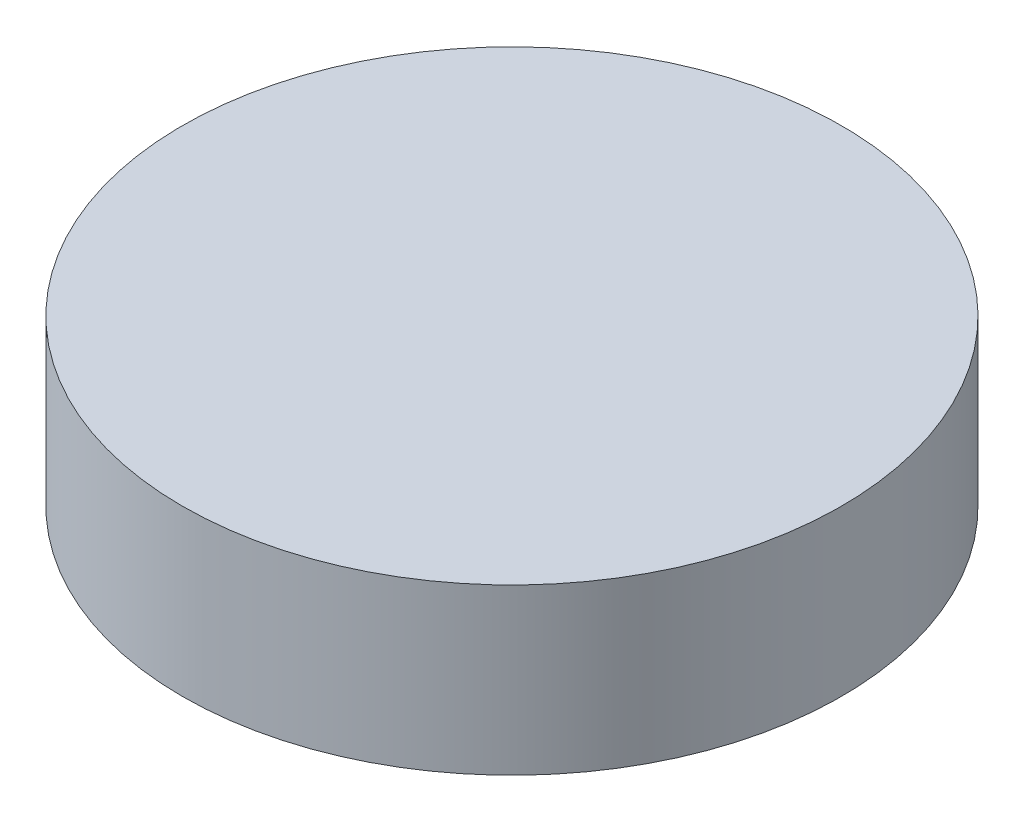
ISO-10303-21;
HEADER;
FILE_DESCRIPTION(('STEP AP214'),'2;1');
FILE_NAME('part.step','',(''),(''),'','','');
FILE_SCHEMA(('AUTOMOTIVE_DESIGN { 1 0 10303 214 1 1 1 1 }'));
ENDSEC;
DATA;
#1=APPLICATION_CONTEXT('core data for automotive mechanical design processes');
#2=APPLICATION_PROTOCOL_DEFINITION('international standard','automotive_design',2000,#1);
#3=PRODUCT_CONTEXT('',#1,'mechanical');
#4=PRODUCT('Part','Part','',(#3));
#5=PRODUCT_RELATED_PRODUCT_CATEGORY('part','',(#4));
#6=PRODUCT_DEFINITION_FORMATION('','',#4);
#7=PRODUCT_DEFINITION_CONTEXT('part definition',#1,'design');
#8=PRODUCT_DEFINITION('design','',#6,#7);
#9=PRODUCT_DEFINITION_SHAPE('','',#8);
#10=(LENGTH_UNIT() NAMED_UNIT(*) SI_UNIT(.MILLI.,.METRE.));
#11=(NAMED_UNIT(*) PLANE_ANGLE_UNIT() SI_UNIT($,.RADIAN.));
#12=(NAMED_UNIT(*) SI_UNIT($,.STERADIAN.) SOLID_ANGLE_UNIT());
#13=UNCERTAINTY_MEASURE_WITH_UNIT(LENGTH_MEASURE(1.E-05),#10,'distance_accuracy_value','');
#14=(GEOMETRIC_REPRESENTATION_CONTEXT(3) GLOBAL_UNCERTAINTY_ASSIGNED_CONTEXT((#13)) GLOBAL_UNIT_ASSIGNED_CONTEXT((#10,
#11,#12)) REPRESENTATION_CONTEXT('',''));
#15=CARTESIAN_POINT('',(0.,0.,0.));
#16=DIRECTION('',(0.,0.,1.));
#17=DIRECTION('',(1.,0.,0.));
#18=AXIS2_PLACEMENT_3D('',#15,#16,#17);
#19=CARTESIAN_POINT('',(0.,1.5,0.));
#20=DIRECTION('',(0.,-1.,0.));
#21=DIRECTION('',(0.,0.,-1.));
#22=AXIS2_PLACEMENT_3D('',#19,#20,#21);
#23=CYLINDRICAL_SURFACE('',#22,3.);
#24=CARTESIAN_POINT('',(0.,1.5,0.));
#25=DIRECTION('',(0.,1.,0.));
#26=DIRECTION('',(0.,0.,1.));
#27=AXIS2_PLACEMENT_3D('',#24,#25,#26);
#28=CIRCLE('',#27,3.);
#29=CARTESIAN_POINT('',(0.,1.5,3.));
#30=VERTEX_POINT('',#29);
#31=EDGE_CURVE('E10',#30,#30,#28,.T.);
#32=ORIENTED_EDGE('',*,*,#31,.F.);
#33=EDGE_LOOP('',(#32));
#34=FACE_BOUND('',#33,.T.);
#35=CARTESIAN_POINT('',(0.,0.,0.));
#36=DIRECTION('',(0.,1.,0.));
#37=DIRECTION('',(0.,0.,1.));
#38=AXIS2_PLACEMENT_3D('',#35,#36,#37);
#39=CIRCLE('',#38,3.);
#40=CARTESIAN_POINT('',(0.,0.,3.));
#41=VERTEX_POINT('',#40);
#42=EDGE_CURVE('E46',#41,#41,#39,.T.);
#43=ORIENTED_EDGE('',*,*,#42,.T.);
#44=EDGE_LOOP('',(#43));
#45=FACE_BOUND('',#44,.T.);
#46=ADVANCED_FACE('F43',(#34,#45),#23,.T.);
#47=CARTESIAN_POINT('',(0.,1.5,0.));
#48=DIRECTION('',(0.,1.,0.));
#49=DIRECTION('',(0.,0.,1.));
#50=AXIS2_PLACEMENT_3D('',#47,#48,#49);
#51=PLANE('',#50);
#52=ORIENTED_EDGE('',*,*,#31,.T.);
#53=EDGE_LOOP('',(#52));
#54=FACE_BOUND('',#53,.T.);
#55=ADVANCED_FACE('F60',(#54),#51,.T.);
#56=CARTESIAN_POINT('',(0.,0.,0.));
#57=DIRECTION('',(0.,1.,0.));
#58=DIRECTION('',(0.,0.,1.));
#59=AXIS2_PLACEMENT_3D('',#56,#57,#58);
#60=PLANE('',#59);
#61=ORIENTED_EDGE('',*,*,#42,.F.);
#62=EDGE_LOOP('',(#61));
#63=FACE_BOUND('',#62,.T.);
#64=ADVANCED_FACE('F58',(#63),#60,.F.);
#65=CLOSED_SHELL('',(#46,#55,#64));
#66=MANIFOLD_SOLID_BREP('B2',#65);
#67=ADVANCED_BREP_SHAPE_REPRESENTATION('',(#18,#66),#14);
#68=SHAPE_DEFINITION_REPRESENTATION(#9,#67);
ENDSEC;
END-ISO-10303-21;
